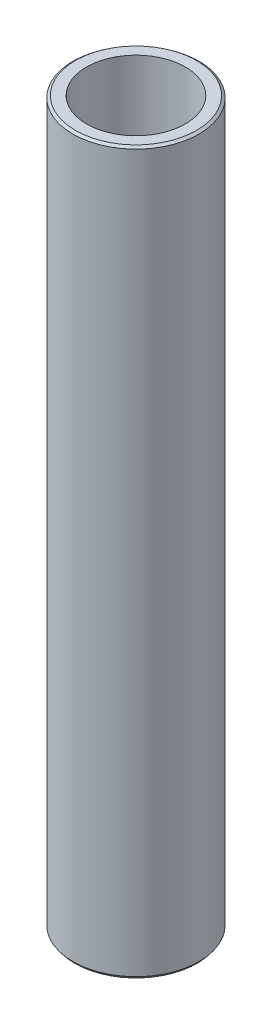
ISO-10303-21;
HEADER;
FILE_DESCRIPTION(('STEP AP214'),'2;1');
FILE_NAME('part.step','',(''),(''),'','','');
FILE_SCHEMA(('AUTOMOTIVE_DESIGN { 1 0 10303 214 1 1 1 1 }'));
ENDSEC;
DATA;
#1=APPLICATION_CONTEXT('core data for automotive mechanical design processes');
#2=APPLICATION_PROTOCOL_DEFINITION('international standard','automotive_design',2000,#1);
#3=PRODUCT_CONTEXT('',#1,'mechanical');
#4=PRODUCT('Part','Part','',(#3));
#5=PRODUCT_RELATED_PRODUCT_CATEGORY('part','',(#4));
#6=PRODUCT_DEFINITION_FORMATION('','',#4);
#7=PRODUCT_DEFINITION_CONTEXT('part definition',#1,'design');
#8=PRODUCT_DEFINITION('design','',#6,#7);
#9=PRODUCT_DEFINITION_SHAPE('','',#8);
#10=(LENGTH_UNIT() NAMED_UNIT(*) SI_UNIT(.MILLI.,.METRE.));
#11=(NAMED_UNIT(*) PLANE_ANGLE_UNIT() SI_UNIT($,.RADIAN.));
#12=(NAMED_UNIT(*) SI_UNIT($,.STERADIAN.) SOLID_ANGLE_UNIT());
#13=UNCERTAINTY_MEASURE_WITH_UNIT(LENGTH_MEASURE(1.E-05),#10,'distance_accuracy_value','');
#14=(GEOMETRIC_REPRESENTATION_CONTEXT(3) GLOBAL_UNCERTAINTY_ASSIGNED_CONTEXT((#13)) GLOBAL_UNIT_ASSIGNED_CONTEXT((#10,
#11,#12)) REPRESENTATION_CONTEXT('',''));
#15=CARTESIAN_POINT('',(0.,0.,0.));
#16=DIRECTION('',(0.,0.,1.));
#17=DIRECTION('',(1.,0.,0.));
#18=AXIS2_PLACEMENT_3D('',#15,#16,#17);
#19=CARTESIAN_POINT('',(0.,600.,0.));
#20=DIRECTION('',(0.,-1.,0.));
#21=DIRECTION('',(0.,0.,-1.));
#22=AXIS2_PLACEMENT_3D('',#19,#20,#21);
#23=CYLINDRICAL_SURFACE('',#22,52.5);
#24=CARTESIAN_POINT('',(0.,598.415037962347,0.));
#25=DIRECTION('',(0.,1.,0.));
#26=DIRECTION('',(0.,0.,1.));
#27=AXIS2_PLACEMENT_3D('',#24,#25,#26);
#28=CIRCLE('',#27,52.5);
#29=CARTESIAN_POINT('',(0.,598.415037962347,52.5));
#30=VERTEX_POINT('',#29);
#31=EDGE_CURVE('E50',#30,#30,#28,.F.);
#32=ORIENTED_EDGE('',*,*,#31,.T.);
#33=EDGE_LOOP('',(#32));
#34=FACE_BOUND('',#33,.T.);
#35=CARTESIAN_POINT('',(0.,2.09679600236257,0.));
#36=DIRECTION('',(0.,1.,0.));
#37=DIRECTION('',(0.,0.,1.));
#38=AXIS2_PLACEMENT_3D('',#35,#36,#37);
#39=CIRCLE('',#38,52.5);
#40=CARTESIAN_POINT('',(0.,2.09679600236257,52.5));
#41=VERTEX_POINT('',#40);
#42=EDGE_CURVE('E51',#41,#41,#39,.T.);
#43=ORIENTED_EDGE('',*,*,#42,.T.);
#44=EDGE_LOOP('',(#43));
#45=FACE_BOUND('',#44,.T.);
#46=ADVANCED_FACE('F39',(#34,#45),#23,.T.);
#47=CARTESIAN_POINT('',(0.,600.,0.));
#48=DIRECTION('',(0.,1.,0.));
#49=DIRECTION('',(0.,0.,1.));
#50=AXIS2_PLACEMENT_3D('',#47,#48,#49);
#51=PLANE('',#50);
#52=CARTESIAN_POINT('',(0.,600.,0.));
#53=DIRECTION('',(0.,1.,0.));
#54=DIRECTION('',(0.,0.,1.));
#55=AXIS2_PLACEMENT_3D('',#52,#53,#54);
#56=CIRCLE('',#55,50.4032039976374);
#57=CARTESIAN_POINT('',(0.,600.,50.4032039976374));
#58=VERTEX_POINT('',#57);
#59=EDGE_CURVE('E54',#58,#58,#56,.T.);
#60=ORIENTED_EDGE('',*,*,#59,.T.);
#61=EDGE_LOOP('',(#60));
#62=FACE_BOUND('',#61,.T.);
#63=CARTESIAN_POINT('',(0.,600.,0.));
#64=DIRECTION('',(0.,1.,0.));
#65=DIRECTION('',(0.,0.,1.));
#66=AXIS2_PLACEMENT_3D('',#63,#64,#65);
#67=CIRCLE('',#66,41.1119274365267);
#68=CARTESIAN_POINT('',(0.,600.,41.1119274365267));
#69=VERTEX_POINT('',#68);
#70=EDGE_CURVE('E58',#69,#69,#67,.T.);
#71=ORIENTED_EDGE('',*,*,#70,.F.);
#72=EDGE_LOOP('',(#71));
#73=FACE_BOUND('',#72,.T.);
#74=ADVANCED_FACE('F69',(#62,#73),#51,.T.);
#75=CARTESIAN_POINT('',(0.,0.,0.));
#76=DIRECTION('',(0.,1.,0.));
#77=DIRECTION('',(0.,0.,1.));
#78=AXIS2_PLACEMENT_3D('',#75,#76,#77);
#79=PLANE('',#78);
#80=CARTESIAN_POINT('',(0.,0.,0.));
#81=DIRECTION('',(0.,1.,0.));
#82=DIRECTION('',(0.,0.,1.));
#83=AXIS2_PLACEMENT_3D('',#80,#81,#82);
#84=CIRCLE('',#83,50.915037962347);
#85=CARTESIAN_POINT('',(0.,0.,50.915037962347));
#86=VERTEX_POINT('',#85);
#87=EDGE_CURVE('E10',#86,#86,#84,.F.);
#88=ORIENTED_EDGE('',*,*,#87,.T.);
#89=EDGE_LOOP('',(#88));
#90=FACE_BOUND('',#89,.T.);
#91=CARTESIAN_POINT('',(0.,0.,0.));
#92=DIRECTION('',(0.,1.,0.));
#93=DIRECTION('',(0.,0.,1.));
#94=AXIS2_PLACEMENT_3D('',#91,#92,#93);
#95=CIRCLE('',#94,41.1119274365267);
#96=CARTESIAN_POINT('',(0.,0.,41.1119274365267));
#97=VERTEX_POINT('',#96);
#98=EDGE_CURVE('E63',#97,#97,#95,.T.);
#99=ORIENTED_EDGE('',*,*,#98,.T.);
#100=EDGE_LOOP('',(#99));
#101=FACE_BOUND('',#100,.T.);
#102=ADVANCED_FACE('F75',(#90,#101),#79,.F.);
#103=CARTESIAN_POINT('',(0.,600.,0.));
#104=DIRECTION('',(0.,-1.,0.));
#105=DIRECTION('',(0.,0.,-1.));
#106=AXIS2_PLACEMENT_3D('',#103,#104,#105);
#107=CYLINDRICAL_SURFACE('',#106,41.1119274365267);
#108=ORIENTED_EDGE('',*,*,#70,.T.);
#109=EDGE_LOOP('',(#108));
#110=FACE_BOUND('',#109,.T.);
#111=ORIENTED_EDGE('',*,*,#98,.F.);
#112=EDGE_LOOP('',(#111));
#113=FACE_BOUND('',#112,.T.);
#114=ADVANCED_FACE('F70',(#110,#113),#107,.F.);
#115=CARTESIAN_POINT('',(0.,600.,0.));
#116=DIRECTION('',(0.,-1.,0.));
#117=DIRECTION('',(0.,0.,-1.));
#118=AXIS2_PLACEMENT_3D('',#115,#116,#117);
#119=CONICAL_SURFACE('',#118,50.4032039976374,0.923531738614545);
#120=ORIENTED_EDGE('',*,*,#31,.F.);
#121=EDGE_LOOP('',(#120));
#122=FACE_BOUND('',#121,.T.);
#123=ORIENTED_EDGE('',*,*,#59,.F.);
#124=EDGE_LOOP('',(#123));
#125=FACE_BOUND('',#124,.T.);
#126=ADVANCED_FACE('F81',(#122,#125),#119,.T.);
#127=CARTESIAN_POINT('',(0.,2.09679600236257,0.));
#128=DIRECTION('',(0.,1.,0.));
#129=DIRECTION('',(0.,0.,1.));
#130=AXIS2_PLACEMENT_3D('',#127,#128,#129);
#131=CONICAL_SURFACE('',#130,52.5,0.647264588180406);
#132=ORIENTED_EDGE('',*,*,#87,.F.);
#133=EDGE_LOOP('',(#132));
#134=FACE_BOUND('',#133,.T.);
#135=ORIENTED_EDGE('',*,*,#42,.F.);
#136=EDGE_LOOP('',(#135));
#137=FACE_BOUND('',#136,.T.);
#138=ADVANCED_FACE('F45',(#134,#137),#131,.T.);
#139=CLOSED_SHELL('',(#46,#74,#102,#114,#126,#138));
#140=MANIFOLD_SOLID_BREP('B2',#139);
#141=ADVANCED_BREP_SHAPE_REPRESENTATION('',(#18,#140),#14);
#142=SHAPE_DEFINITION_REPRESENTATION(#9,#141);
ENDSEC;
END-ISO-10303-21;
